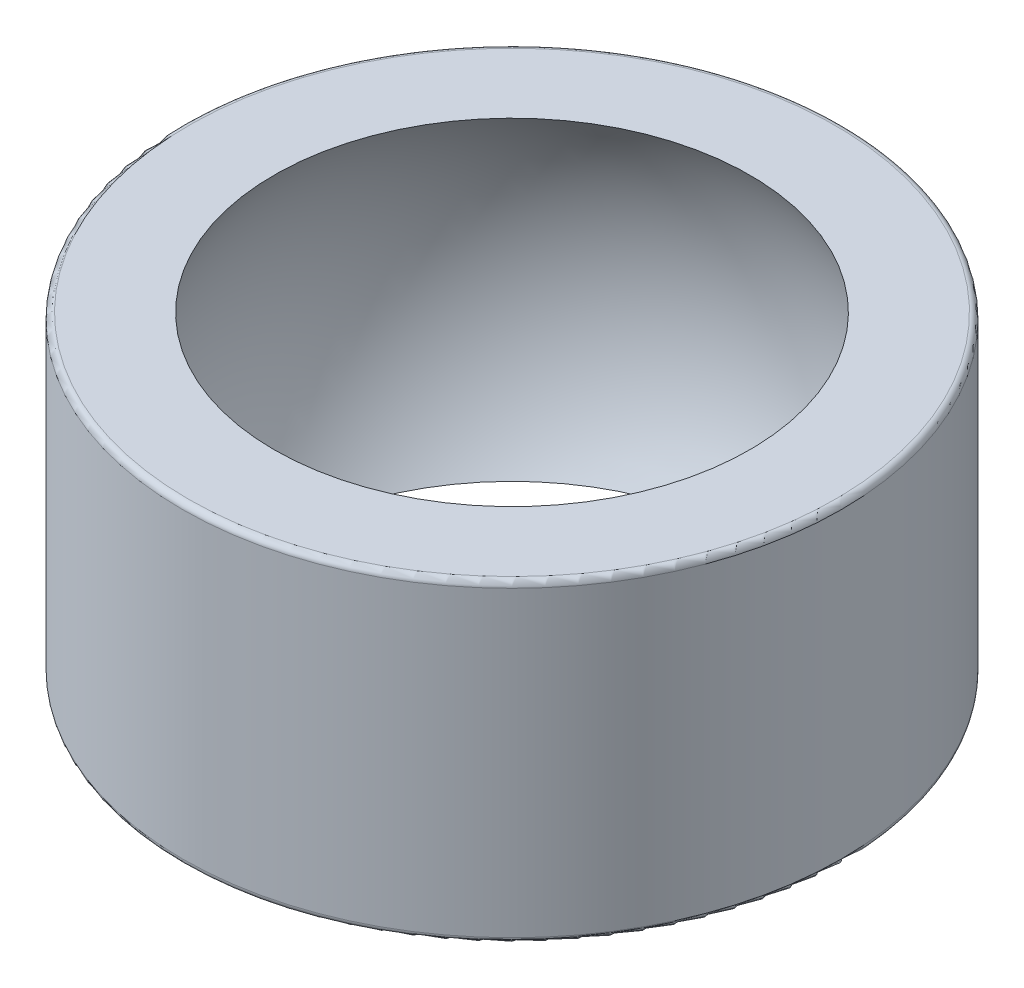
ISO-10303-21;
HEADER;
FILE_DESCRIPTION(('STEP AP214'),'2;1');
FILE_NAME('part.step','',(''),(''),'','','');
FILE_SCHEMA(('AUTOMOTIVE_DESIGN { 1 0 10303 214 1 1 1 1 }'));
ENDSEC;
DATA;
#1=APPLICATION_CONTEXT('core data for automotive mechanical design processes');
#2=APPLICATION_PROTOCOL_DEFINITION('international standard','automotive_design',2000,#1);
#3=PRODUCT_CONTEXT('',#1,'mechanical');
#4=PRODUCT('Part','Part','',(#3));
#5=PRODUCT_RELATED_PRODUCT_CATEGORY('part','',(#4));
#6=PRODUCT_DEFINITION_FORMATION('','',#4);
#7=PRODUCT_DEFINITION_CONTEXT('part definition',#1,'design');
#8=PRODUCT_DEFINITION('design','',#6,#7);
#9=PRODUCT_DEFINITION_SHAPE('','',#8);
#10=(LENGTH_UNIT() NAMED_UNIT(*) SI_UNIT(.MILLI.,.METRE.));
#11=(NAMED_UNIT(*) PLANE_ANGLE_UNIT() SI_UNIT($,.RADIAN.));
#12=(NAMED_UNIT(*) SI_UNIT($,.STERADIAN.) SOLID_ANGLE_UNIT());
#13=UNCERTAINTY_MEASURE_WITH_UNIT(LENGTH_MEASURE(1.E-05),#10,'distance_accuracy_value','');
#14=(GEOMETRIC_REPRESENTATION_CONTEXT(3) GLOBAL_UNCERTAINTY_ASSIGNED_CONTEXT((#13)) GLOBAL_UNIT_ASSIGNED_CONTEXT((#10,
#11,#12)) REPRESENTATION_CONTEXT('',''));
#15=CARTESIAN_POINT('',(0.,0.,0.));
#16=DIRECTION('',(0.,0.,1.));
#17=DIRECTION('',(1.,0.,0.));
#18=AXIS2_PLACEMENT_3D('',#15,#16,#17);
#19=CARTESIAN_POINT('',(0.,5.25,0.));
#20=DIRECTION('',(0.,-1.,0.));
#21=DIRECTION('',(0.,0.,-1.));
#22=AXIS2_PLACEMENT_3D('',#19,#20,#21);
#23=CYLINDRICAL_SURFACE('',#22,11.);
#24=CARTESIAN_POINT('',(0.,-5.05,0.));
#25=DIRECTION('',(0.,1.,0.));
#26=DIRECTION('',(0.,0.,1.));
#27=AXIS2_PLACEMENT_3D('',#24,#25,#26);
#28=CIRCLE('',#27,11.);
#29=CARTESIAN_POINT('',(0.,-5.05,11.));
#30=VERTEX_POINT('',#29);
#31=EDGE_CURVE('E42',#30,#30,#28,.T.);
#32=ORIENTED_EDGE('',*,*,#31,.T.);
#33=EDGE_LOOP('',(#32));
#34=FACE_BOUND('',#33,.T.);
#35=CARTESIAN_POINT('',(0.,5.05,0.));
#36=DIRECTION('',(0.,1.,0.));
#37=DIRECTION('',(0.,0.,1.));
#38=AXIS2_PLACEMENT_3D('',#35,#36,#37);
#39=CIRCLE('',#38,11.);
#40=CARTESIAN_POINT('',(0.,5.05,11.));
#41=VERTEX_POINT('',#40);
#42=EDGE_CURVE('E46',#41,#41,#39,.F.);
#43=ORIENTED_EDGE('',*,*,#42,.T.);
#44=EDGE_LOOP('',(#43));
#45=FACE_BOUND('',#44,.T.);
#46=ADVANCED_FACE('F31',(#34,#45),#23,.T.);
#47=CARTESIAN_POINT('',(0.,5.25,0.));
#48=DIRECTION('',(0.,1.,0.));
#49=DIRECTION('',(0.,0.,1.));
#50=AXIS2_PLACEMENT_3D('',#47,#48,#49);
#51=PLANE('',#50);
#52=CARTESIAN_POINT('',(0.,5.25,0.));
#53=DIRECTION('',(0.,1.,0.));
#54=DIRECTION('',(0.,0.,1.));
#55=AXIS2_PLACEMENT_3D('',#52,#53,#54);
#56=CIRCLE('',#55,10.8);
#57=CARTESIAN_POINT('',(0.,5.25,10.8));
#58=VERTEX_POINT('',#57);
#59=EDGE_CURVE('E10',#58,#58,#56,.T.);
#60=ORIENTED_EDGE('',*,*,#59,.T.);
#61=EDGE_LOOP('',(#60));
#62=FACE_BOUND('',#61,.T.);
#63=CARTESIAN_POINT('',(0.,5.25,0.));
#64=DIRECTION('',(0.,1.,0.));
#65=DIRECTION('',(0.,0.,1.));
#66=AXIS2_PLACEMENT_3D('',#63,#64,#65);
#67=CIRCLE('',#66,7.94153007927314);
#68=CARTESIAN_POINT('',(0.,5.25,7.94153007927314));
#69=VERTEX_POINT('',#68);
#70=EDGE_CURVE('E51',#69,#69,#67,.T.);
#71=ORIENTED_EDGE('',*,*,#70,.F.);
#72=EDGE_LOOP('',(#71));
#73=FACE_BOUND('',#72,.T.);
#74=ADVANCED_FACE('F61',(#62,#73),#51,.T.);
#75=CARTESIAN_POINT('',(0.,-5.25,0.));
#76=DIRECTION('',(0.,1.,0.));
#77=DIRECTION('',(0.,0.,1.));
#78=AXIS2_PLACEMENT_3D('',#75,#76,#77);
#79=PLANE('',#78);
#80=CARTESIAN_POINT('',(0.,-5.25,0.));
#81=DIRECTION('',(0.,1.,0.));
#82=DIRECTION('',(0.,0.,1.));
#83=AXIS2_PLACEMENT_3D('',#80,#81,#82);
#84=CIRCLE('',#83,10.8);
#85=CARTESIAN_POINT('',(0.,-5.25,10.8));
#86=VERTEX_POINT('',#85);
#87=EDGE_CURVE('E38',#86,#86,#84,.F.);
#88=ORIENTED_EDGE('',*,*,#87,.T.);
#89=EDGE_LOOP('',(#88));
#90=FACE_BOUND('',#89,.T.);
#91=CARTESIAN_POINT('',(0.,-5.25,0.));
#92=DIRECTION('',(0.,1.,0.));
#93=DIRECTION('',(0.,0.,1.));
#94=AXIS2_PLACEMENT_3D('',#91,#92,#93);
#95=CIRCLE('',#94,7.94153007927314);
#96=CARTESIAN_POINT('',(0.,-5.25,7.94153007927314));
#97=VERTEX_POINT('',#96);
#98=EDGE_CURVE('E52',#97,#97,#95,.T.);
#99=ORIENTED_EDGE('',*,*,#98,.T.);
#100=EDGE_LOOP('',(#99));
#101=FACE_BOUND('',#100,.T.);
#102=ADVANCED_FACE('F63',(#90,#101),#79,.F.);
#103=CARTESIAN_POINT('',(0.,0.,0.));
#104=DIRECTION('',(0.,-1.,0.));
#105=DIRECTION('',(-1.,0.,0.));
#106=AXIS2_PLACEMENT_3D('',#103,#104,#105);
#107=SPHERICAL_SURFACE('',#106,9.52);
#108=ORIENTED_EDGE('',*,*,#70,.T.);
#109=EDGE_LOOP('',(#108));
#110=FACE_BOUND('',#109,.T.);
#111=ORIENTED_EDGE('',*,*,#98,.F.);
#112=EDGE_LOOP('',(#111));
#113=FACE_BOUND('',#112,.T.);
#114=ADVANCED_FACE('F58',(#110,#113),#107,.F.);
#115=CARTESIAN_POINT('',(0.,-5.05,0.));
#116=DIRECTION('',(0.,1.,0.));
#117=DIRECTION('',(0.,0.,1.));
#118=AXIS2_PLACEMENT_3D('',#115,#116,#117);
#119=TOROIDAL_SURFACE('',#118,10.8,0.2);
#120=ORIENTED_EDGE('',*,*,#87,.F.);
#121=EDGE_LOOP('',(#120));
#122=FACE_BOUND('',#121,.T.);
#123=ORIENTED_EDGE('',*,*,#31,.F.);
#124=EDGE_LOOP('',(#123));
#125=FACE_BOUND('',#124,.T.);
#126=ADVANCED_FACE('F73',(#122,#125),#119,.T.);
#127=CARTESIAN_POINT('',(0.,5.05,0.));
#128=DIRECTION('',(0.,1.,0.));
#129=DIRECTION('',(0.,0.,1.));
#130=AXIS2_PLACEMENT_3D('',#127,#128,#129);
#131=TOROIDAL_SURFACE('',#130,10.8,0.2);
#132=ORIENTED_EDGE('',*,*,#42,.F.);
#133=EDGE_LOOP('',(#132));
#134=FACE_BOUND('',#133,.T.);
#135=ORIENTED_EDGE('',*,*,#59,.F.);
#136=EDGE_LOOP('',(#135));
#137=FACE_BOUND('',#136,.T.);
#138=ADVANCED_FACE('F33',(#134,#137),#131,.T.);
#139=CLOSED_SHELL('',(#46,#74,#102,#114,#126,#138));
#140=MANIFOLD_SOLID_BREP('B2',#139);
#141=ADVANCED_BREP_SHAPE_REPRESENTATION('',(#18,#140),#14);
#142=SHAPE_DEFINITION_REPRESENTATION(#9,#141);
ENDSEC;
END-ISO-10303-21;
